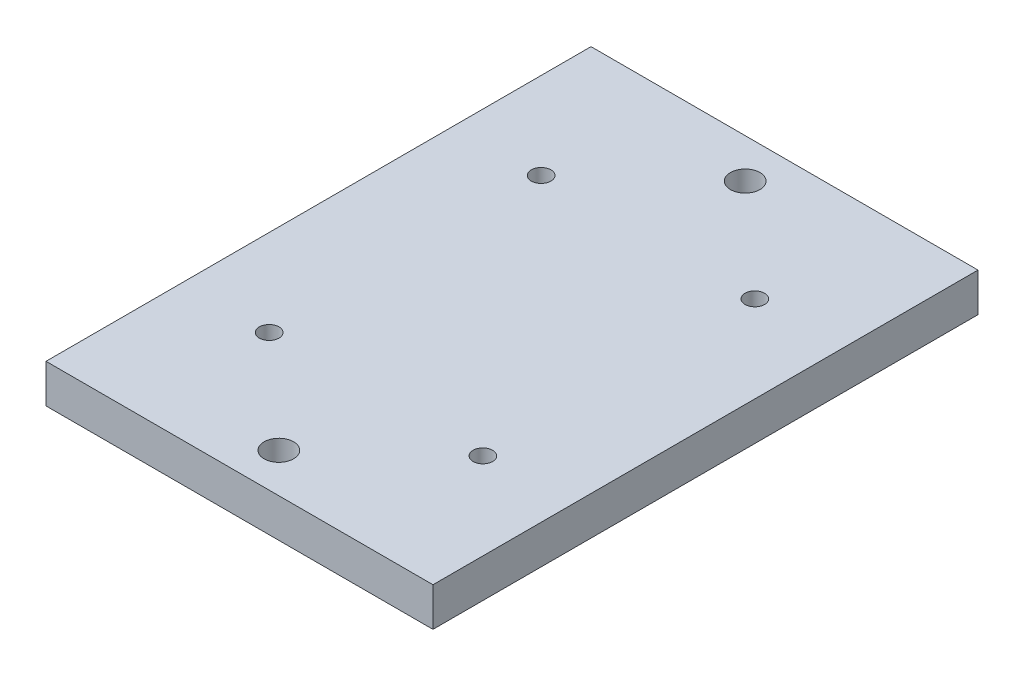
ISO-10303-21;
HEADER;
FILE_DESCRIPTION(('STEP AP214'),'2;1');
FILE_NAME('part.step','',(''),(''),'','','');
FILE_SCHEMA(('AUTOMOTIVE_DESIGN { 1 0 10303 214 1 1 1 1 }'));
ENDSEC;
DATA;
#1=APPLICATION_CONTEXT('core data for automotive mechanical design processes');
#2=APPLICATION_PROTOCOL_DEFINITION('international standard','automotive_design',2000,#1);
#3=PRODUCT_CONTEXT('',#1,'mechanical');
#4=PRODUCT('Part','Part','',(#3));
#5=PRODUCT_RELATED_PRODUCT_CATEGORY('part','',(#4));
#6=PRODUCT_DEFINITION_FORMATION('','',#4);
#7=PRODUCT_DEFINITION_CONTEXT('part definition',#1,'design');
#8=PRODUCT_DEFINITION('design','',#6,#7);
#9=PRODUCT_DEFINITION_SHAPE('','',#8);
#10=(LENGTH_UNIT() NAMED_UNIT(*) SI_UNIT(.MILLI.,.METRE.));
#11=(NAMED_UNIT(*) PLANE_ANGLE_UNIT() SI_UNIT($,.RADIAN.));
#12=(NAMED_UNIT(*) SI_UNIT($,.STERADIAN.) SOLID_ANGLE_UNIT());
#13=UNCERTAINTY_MEASURE_WITH_UNIT(LENGTH_MEASURE(1.E-05),#10,'distance_accuracy_value','');
#14=(GEOMETRIC_REPRESENTATION_CONTEXT(3) GLOBAL_UNCERTAINTY_ASSIGNED_CONTEXT((#13)) GLOBAL_UNIT_ASSIGNED_CONTEXT((#10,
#11,#12)) REPRESENTATION_CONTEXT('',''));
#15=CARTESIAN_POINT('',(0.,0.,0.));
#16=DIRECTION('',(0.,0.,1.));
#17=DIRECTION('',(1.,0.,0.));
#18=AXIS2_PLACEMENT_3D('',#15,#16,#17);
#19=CARTESIAN_POINT('',(0.,6.32,0.));
#20=DIRECTION('',(1.,0.,0.));
#21=DIRECTION('',(0.,0.,-1.));
#22=AXIS2_PLACEMENT_3D('',#19,#20,#21);
#23=PLANE('',#22);
#24=DIRECTION('',(0.,0.,1.));
#25=VECTOR('',#24,1.);
#26=CARTESIAN_POINT('',(0.,0.,0.));
#27=LINE('',#26,#25);
#28=CARTESIAN_POINT('',(0.,0.,-89.08));
#29=VERTEX_POINT('',#28);
#30=CARTESIAN_POINT('',(0.,0.,0.));
#31=VERTEX_POINT('',#30);
#32=EDGE_CURVE('E144',#29,#31,#27,.T.);
#33=ORIENTED_EDGE('',*,*,#32,.T.);
#34=DIRECTION('',(0.,-1.,0.));
#35=VECTOR('',#34,1.);
#36=CARTESIAN_POINT('',(0.,6.32,0.));
#37=LINE('',#36,#35);
#38=CARTESIAN_POINT('',(0.,6.32,0.));
#39=VERTEX_POINT('',#38);
#40=EDGE_CURVE('E125',#39,#31,#37,.T.);
#41=ORIENTED_EDGE('',*,*,#40,.F.);
#42=DIRECTION('',(0.,0.,1.));
#43=VECTOR('',#42,1.);
#44=CARTESIAN_POINT('',(0.,6.32,0.));
#45=LINE('',#44,#43);
#46=CARTESIAN_POINT('',(0.,6.32,-89.08));
#47=VERTEX_POINT('',#46);
#48=EDGE_CURVE('E132',#47,#39,#45,.T.);
#49=ORIENTED_EDGE('',*,*,#48,.F.);
#50=DIRECTION('',(0.,-1.,0.));
#51=VECTOR('',#50,1.);
#52=CARTESIAN_POINT('',(0.,6.32,-89.08));
#53=LINE('',#52,#51);
#54=EDGE_CURVE('E236',#47,#29,#53,.T.);
#55=ORIENTED_EDGE('',*,*,#54,.T.);
#56=EDGE_LOOP('',(#33,#41,#49,#55));
#57=FACE_BOUND('',#56,.T.);
#58=ADVANCED_FACE('F33',(#57),#23,.F.);
#59=CARTESIAN_POINT('',(0.,6.32,0.));
#60=DIRECTION('',(0.,0.,-1.));
#61=DIRECTION('',(-1.,0.,0.));
#62=AXIS2_PLACEMENT_3D('',#59,#60,#61);
#63=PLANE('',#62);
#64=DIRECTION('',(1.,0.,0.));
#65=VECTOR('',#64,1.);
#66=CARTESIAN_POINT('',(0.,0.,0.));
#67=LINE('',#66,#65);
#68=CARTESIAN_POINT('',(63.25,0.,0.));
#69=VERTEX_POINT('',#68);
#70=EDGE_CURVE('E238',#31,#69,#67,.T.);
#71=ORIENTED_EDGE('',*,*,#70,.T.);
#72=DIRECTION('',(0.,-1.,0.));
#73=VECTOR('',#72,1.);
#74=CARTESIAN_POINT('',(63.25,6.32,0.));
#75=LINE('',#74,#73);
#76=CARTESIAN_POINT('',(63.25,6.32,0.));
#77=VERTEX_POINT('',#76);
#78=EDGE_CURVE('E128',#77,#69,#75,.T.);
#79=ORIENTED_EDGE('',*,*,#78,.F.);
#80=DIRECTION('',(1.,0.,0.));
#81=VECTOR('',#80,1.);
#82=CARTESIAN_POINT('',(0.,6.32,0.));
#83=LINE('',#82,#81);
#84=EDGE_CURVE('E121',#39,#77,#83,.T.);
#85=ORIENTED_EDGE('',*,*,#84,.F.);
#86=ORIENTED_EDGE('',*,*,#40,.T.);
#87=EDGE_LOOP('',(#71,#79,#85,#86));
#88=FACE_BOUND('',#87,.T.);
#89=ADVANCED_FACE('F123',(#88),#63,.F.);
#90=CARTESIAN_POINT('',(63.25,6.32,0.));
#91=DIRECTION('',(-1.,0.,0.));
#92=DIRECTION('',(0.,0.,1.));
#93=AXIS2_PLACEMENT_3D('',#90,#91,#92);
#94=PLANE('',#93);
#95=DIRECTION('',(0.,0.,-1.));
#96=VECTOR('',#95,1.);
#97=CARTESIAN_POINT('',(63.25,0.,0.));
#98=LINE('',#97,#96);
#99=CARTESIAN_POINT('',(63.25,0.,-89.08));
#100=VERTEX_POINT('',#99);
#101=EDGE_CURVE('E240',#69,#100,#98,.T.);
#102=ORIENTED_EDGE('',*,*,#101,.T.);
#103=DIRECTION('',(0.,-1.,0.));
#104=VECTOR('',#103,1.);
#105=CARTESIAN_POINT('',(63.25,6.32,-89.08));
#106=LINE('',#105,#104);
#107=CARTESIAN_POINT('',(63.25,6.32,-89.08));
#108=VERTEX_POINT('',#107);
#109=EDGE_CURVE('E149',#108,#100,#106,.T.);
#110=ORIENTED_EDGE('',*,*,#109,.F.);
#111=DIRECTION('',(0.,0.,-1.));
#112=VECTOR('',#111,1.);
#113=CARTESIAN_POINT('',(63.25,6.32,0.));
#114=LINE('',#113,#112);
#115=EDGE_CURVE('E131',#77,#108,#114,.T.);
#116=ORIENTED_EDGE('',*,*,#115,.F.);
#117=ORIENTED_EDGE('',*,*,#78,.T.);
#118=EDGE_LOOP('',(#102,#110,#116,#117));
#119=FACE_BOUND('',#118,.T.);
#120=ADVANCED_FACE('F251',(#119),#94,.F.);
#121=CARTESIAN_POINT('',(0.,6.32,-89.08));
#122=DIRECTION('',(0.,0.,1.));
#123=DIRECTION('',(1.,0.,0.));
#124=AXIS2_PLACEMENT_3D('',#121,#122,#123);
#125=PLANE('',#124);
#126=DIRECTION('',(-1.,0.,0.));
#127=VECTOR('',#126,1.);
#128=CARTESIAN_POINT('',(0.,0.,-89.08));
#129=LINE('',#128,#127);
#130=EDGE_CURVE('E141',#100,#29,#129,.T.);
#131=ORIENTED_EDGE('',*,*,#130,.T.);
#132=ORIENTED_EDGE('',*,*,#54,.F.);
#133=DIRECTION('',(-1.,0.,0.));
#134=VECTOR('',#133,1.);
#135=CARTESIAN_POINT('',(0.,6.32,-89.08));
#136=LINE('',#135,#134);
#137=EDGE_CURVE('E137',#108,#47,#136,.T.);
#138=ORIENTED_EDGE('',*,*,#137,.F.);
#139=ORIENTED_EDGE('',*,*,#109,.T.);
#140=EDGE_LOOP('',(#131,#132,#138,#139));
#141=FACE_BOUND('',#140,.T.);
#142=ADVANCED_FACE('F247',(#141),#125,.F.);
#143=CARTESIAN_POINT('',(0.,6.32,0.));
#144=DIRECTION('',(0.,-1.,0.));
#145=DIRECTION('',(0.,0.,-1.));
#146=AXIS2_PLACEMENT_3D('',#143,#144,#145);
#147=PLANE('',#146);
#148=CARTESIAN_POINT('',(14.16,6.32,-22.315));
#149=DIRECTION('',(0.,-1.,0.));
#150=DIRECTION('',(0.,0.,-1.));
#151=AXIS2_PLACEMENT_3D('',#148,#149,#150);
#152=CIRCLE('',#151,1.6);
#153=CARTESIAN_POINT('',(14.16,6.32,-23.915));
#154=VERTEX_POINT('',#153);
#155=EDGE_CURVE('E429',#154,#154,#152,.T.);
#156=ORIENTED_EDGE('',*,*,#155,.T.);
#157=EDGE_LOOP('',(#156));
#158=FACE_BOUND('',#157,.T.);
#159=CARTESIAN_POINT('',(14.16,6.32,-66.765));
#160=DIRECTION('',(0.,-1.,0.));
#161=DIRECTION('',(0.,0.,-1.));
#162=AXIS2_PLACEMENT_3D('',#159,#160,#161);
#163=CIRCLE('',#162,1.6);
#164=CARTESIAN_POINT('',(14.16,6.32,-68.365));
#165=VERTEX_POINT('',#164);
#166=EDGE_CURVE('E437',#165,#165,#163,.T.);
#167=ORIENTED_EDGE('',*,*,#166,.T.);
#168=EDGE_LOOP('',(#167));
#169=FACE_BOUND('',#168,.T.);
#170=CARTESIAN_POINT('',(49.09,6.32,-66.765));
#171=DIRECTION('',(0.,-1.,0.));
#172=DIRECTION('',(0.,0.,-1.));
#173=AXIS2_PLACEMENT_3D('',#170,#171,#172);
#174=CIRCLE('',#173,1.6);
#175=CARTESIAN_POINT('',(49.09,6.32,-68.365));
#176=VERTEX_POINT('',#175);
#177=EDGE_CURVE('E443',#176,#176,#174,.T.);
#178=ORIENTED_EDGE('',*,*,#177,.T.);
#179=EDGE_LOOP('',(#178));
#180=FACE_BOUND('',#179,.T.);
#181=CARTESIAN_POINT('',(49.09,6.32,-22.315));
#182=DIRECTION('',(0.,-1.,0.));
#183=DIRECTION('',(0.,0.,-1.));
#184=AXIS2_PLACEMENT_3D('',#181,#182,#183);
#185=CIRCLE('',#184,1.6);
#186=CARTESIAN_POINT('',(49.09,6.32,-23.915));
#187=VERTEX_POINT('',#186);
#188=EDGE_CURVE('E191',#187,#187,#185,.T.);
#189=ORIENTED_EDGE('',*,*,#188,.T.);
#190=EDGE_LOOP('',(#189));
#191=FACE_BOUND('',#190,.T.);
#192=CARTESIAN_POINT('',(31.625,6.32,-6.43));
#193=DIRECTION('',(0.,-1.,0.));
#194=DIRECTION('',(0.,0.,-1.));
#195=AXIS2_PLACEMENT_3D('',#192,#193,#194);
#196=CIRCLE('',#195,2.415);
#197=CARTESIAN_POINT('',(31.625,6.32,-8.845));
#198=VERTEX_POINT('',#197);
#199=EDGE_CURVE('E223',#198,#198,#196,.T.);
#200=ORIENTED_EDGE('',*,*,#199,.T.);
#201=EDGE_LOOP('',(#200));
#202=FACE_BOUND('',#201,.T.);
#203=CARTESIAN_POINT('',(31.625,6.32,-82.65));
#204=DIRECTION('',(0.,-1.,0.));
#205=DIRECTION('',(0.,0.,-1.));
#206=AXIS2_PLACEMENT_3D('',#203,#204,#205);
#207=CIRCLE('',#206,2.415);
#208=CARTESIAN_POINT('',(31.625,6.32,-85.065));
#209=VERTEX_POINT('',#208);
#210=EDGE_CURVE('E229',#209,#209,#207,.T.);
#211=ORIENTED_EDGE('',*,*,#210,.T.);
#212=EDGE_LOOP('',(#211));
#213=FACE_BOUND('',#212,.T.);
#214=ORIENTED_EDGE('',*,*,#48,.T.);
#215=ORIENTED_EDGE('',*,*,#84,.T.);
#216=ORIENTED_EDGE('',*,*,#115,.T.);
#217=ORIENTED_EDGE('',*,*,#137,.T.);
#218=EDGE_LOOP('',(#214,#215,#216,#217));
#219=FACE_BOUND('',#218,.T.);
#220=ADVANCED_FACE('F135',(#158,#169,#180,#191,#202,#213,#219),#147,.F.);
#221=CARTESIAN_POINT('',(0.,0.,0.));
#222=DIRECTION('',(0.,-1.,0.));
#223=DIRECTION('',(0.,0.,-1.));
#224=AXIS2_PLACEMENT_3D('',#221,#222,#223);
#225=PLANE('',#224);
#226=DIRECTION('',(0.,0.,1.));
#227=VECTOR('',#226,1.);
#228=CARTESIAN_POINT('',(56.985,0.,-12.765));
#229=LINE('',#228,#227);
#230=CARTESIAN_POINT('',(56.985,0.,-69.965));
#231=VERTEX_POINT('',#230);
#232=CARTESIAN_POINT('',(56.985,0.,-19.115));
#233=VERTEX_POINT('',#232);
#234=EDGE_CURVE('E184',#231,#233,#229,.T.);
#235=ORIENTED_EDGE('',*,*,#234,.F.);
#236=CARTESIAN_POINT('',(50.635,0.,-69.965));
#237=DIRECTION('',(0.,-1.,0.));
#238=DIRECTION('',(0.,0.,-1.));
#239=AXIS2_PLACEMENT_3D('',#236,#237,#238);
#240=CIRCLE('',#239,6.35);
#241=CARTESIAN_POINT('',(50.635,0.,-76.315));
#242=VERTEX_POINT('',#241);
#243=EDGE_CURVE('E179',#231,#242,#240,.F.);
#244=ORIENTED_EDGE('',*,*,#243,.T.);
#245=DIRECTION('',(1.,0.,0.));
#246=VECTOR('',#245,1.);
#247=CARTESIAN_POINT('',(6.265,0.,-76.315));
#248=LINE('',#247,#246);
#249=CARTESIAN_POINT('',(12.615,0.,-76.315));
#250=VERTEX_POINT('',#249);
#251=EDGE_CURVE('E210',#250,#242,#248,.T.);
#252=ORIENTED_EDGE('',*,*,#251,.F.);
#253=CARTESIAN_POINT('',(12.615,0.,-69.965));
#254=DIRECTION('',(0.,-1.,0.));
#255=DIRECTION('',(0.,0.,-1.));
#256=AXIS2_PLACEMENT_3D('',#253,#254,#255);
#257=CIRCLE('',#256,6.35);
#258=CARTESIAN_POINT('',(6.265,0.,-69.965));
#259=VERTEX_POINT('',#258);
#260=EDGE_CURVE('E177',#250,#259,#257,.F.);
#261=ORIENTED_EDGE('',*,*,#260,.T.);
#262=DIRECTION('',(0.,0.,-1.));
#263=VECTOR('',#262,1.);
#264=CARTESIAN_POINT('',(6.265,0.,-12.765));
#265=LINE('',#264,#263);
#266=CARTESIAN_POINT('',(6.265,0.,-19.115));
#267=VERTEX_POINT('',#266);
#268=EDGE_CURVE('E218',#267,#259,#265,.T.);
#269=ORIENTED_EDGE('',*,*,#268,.F.);
#270=CARTESIAN_POINT('',(12.615,0.,-19.115));
#271=DIRECTION('',(0.,-1.,0.));
#272=DIRECTION('',(0.,0.,-1.));
#273=AXIS2_PLACEMENT_3D('',#270,#271,#272);
#274=CIRCLE('',#273,6.35);
#275=CARTESIAN_POINT('',(12.615,0.,-12.765));
#276=VERTEX_POINT('',#275);
#277=EDGE_CURVE('E11',#267,#276,#274,.F.);
#278=ORIENTED_EDGE('',*,*,#277,.T.);
#279=DIRECTION('',(-1.,0.,0.));
#280=VECTOR('',#279,1.);
#281=CARTESIAN_POINT('',(6.265,0.,-12.765));
#282=LINE('',#281,#280);
#283=CARTESIAN_POINT('',(50.635,0.,-12.765));
#284=VERTEX_POINT('',#283);
#285=EDGE_CURVE('E185',#284,#276,#282,.T.);
#286=ORIENTED_EDGE('',*,*,#285,.F.);
#287=CARTESIAN_POINT('',(50.635,0.,-19.115));
#288=DIRECTION('',(0.,-1.,0.));
#289=DIRECTION('',(0.,0.,-1.));
#290=AXIS2_PLACEMENT_3D('',#287,#288,#289);
#291=CIRCLE('',#290,6.35);
#292=EDGE_CURVE('E41',#284,#233,#291,.F.);
#293=ORIENTED_EDGE('',*,*,#292,.T.);
#294=EDGE_LOOP('',(#235,#244,#252,#261,#269,#278,#286,#293));
#295=FACE_BOUND('',#294,.T.);
#296=CARTESIAN_POINT('',(31.625,0.,-6.43));
#297=DIRECTION('',(0.,-1.,0.));
#298=DIRECTION('',(0.,0.,-1.));
#299=AXIS2_PLACEMENT_3D('',#296,#297,#298);
#300=CIRCLE('',#299,2.415);
#301=CARTESIAN_POINT('',(31.625,0.,-8.845));
#302=VERTEX_POINT('',#301);
#303=EDGE_CURVE('E215',#302,#302,#300,.T.);
#304=ORIENTED_EDGE('',*,*,#303,.F.);
#305=EDGE_LOOP('',(#304));
#306=FACE_BOUND('',#305,.T.);
#307=CARTESIAN_POINT('',(31.625,0.,-82.65));
#308=DIRECTION('',(0.,-1.,0.));
#309=DIRECTION('',(0.,0.,-1.));
#310=AXIS2_PLACEMENT_3D('',#307,#308,#309);
#311=CIRCLE('',#310,2.415);
#312=CARTESIAN_POINT('',(31.625,0.,-85.065));
#313=VERTEX_POINT('',#312);
#314=EDGE_CURVE('E226',#313,#313,#311,.T.);
#315=ORIENTED_EDGE('',*,*,#314,.F.);
#316=EDGE_LOOP('',(#315));
#317=FACE_BOUND('',#316,.T.);
#318=ORIENTED_EDGE('',*,*,#32,.F.);
#319=ORIENTED_EDGE('',*,*,#130,.F.);
#320=ORIENTED_EDGE('',*,*,#101,.F.);
#321=ORIENTED_EDGE('',*,*,#70,.F.);
#322=EDGE_LOOP('',(#318,#319,#320,#321));
#323=FACE_BOUND('',#322,.T.);
#324=ADVANCED_FACE('F182',(#295,#306,#317,#323),#225,.T.);
#325=CARTESIAN_POINT('',(31.625,6.32,-82.65));
#326=DIRECTION('',(0.,-1.,0.));
#327=DIRECTION('',(0.,0.,-1.));
#328=AXIS2_PLACEMENT_3D('',#325,#326,#327);
#329=CYLINDRICAL_SURFACE('',#328,2.415);
#330=ORIENTED_EDGE('',*,*,#210,.F.);
#331=EDGE_LOOP('',(#330));
#332=FACE_BOUND('',#331,.T.);
#333=ORIENTED_EDGE('',*,*,#314,.T.);
#334=EDGE_LOOP('',(#333));
#335=FACE_BOUND('',#334,.T.);
#336=ADVANCED_FACE('F312',(#332,#335),#329,.F.);
#337=CARTESIAN_POINT('',(31.625,6.32,-6.43));
#338=DIRECTION('',(0.,-1.,0.));
#339=DIRECTION('',(0.,0.,-1.));
#340=AXIS2_PLACEMENT_3D('',#337,#338,#339);
#341=CYLINDRICAL_SURFACE('',#340,2.415);
#342=ORIENTED_EDGE('',*,*,#199,.F.);
#343=EDGE_LOOP('',(#342));
#344=FACE_BOUND('',#343,.T.);
#345=ORIENTED_EDGE('',*,*,#303,.T.);
#346=EDGE_LOOP('',(#345));
#347=FACE_BOUND('',#346,.T.);
#348=ADVANCED_FACE('F304',(#344,#347),#341,.F.);
#349=CARTESIAN_POINT('',(56.985,1.37,-12.765));
#350=DIRECTION('',(1.,0.,0.));
#351=DIRECTION('',(0.,0.,-1.));
#352=AXIS2_PLACEMENT_3D('',#349,#350,#351);
#353=PLANE('',#352);
#354=DIRECTION('',(0.,0.,1.));
#355=VECTOR('',#354,1.);
#356=CARTESIAN_POINT('',(56.985,1.37,-12.765));
#357=LINE('',#356,#355);
#358=CARTESIAN_POINT('',(56.985,1.37,-69.965));
#359=VERTEX_POINT('',#358);
#360=CARTESIAN_POINT('',(56.985,1.37,-19.115));
#361=VERTEX_POINT('',#360);
#362=EDGE_CURVE('E202',#359,#361,#357,.T.);
#363=ORIENTED_EDGE('',*,*,#362,.F.);
#364=DIRECTION('',(0.,-1.,0.));
#365=VECTOR('',#364,1.);
#366=CARTESIAN_POINT('',(56.985,0.,-69.965));
#367=LINE('',#366,#365);
#368=EDGE_CURVE('E170',#359,#231,#367,.T.);
#369=ORIENTED_EDGE('',*,*,#368,.T.);
#370=ORIENTED_EDGE('',*,*,#234,.T.);
#371=DIRECTION('',(0.,-1.,0.));
#372=VECTOR('',#371,1.);
#373=CARTESIAN_POINT('',(56.985,1.37,-19.115));
#374=LINE('',#373,#372);
#375=EDGE_CURVE('E168',#233,#361,#374,.F.);
#376=ORIENTED_EDGE('',*,*,#375,.T.);
#377=EDGE_LOOP('',(#363,#369,#370,#376));
#378=FACE_BOUND('',#377,.T.);
#379=ADVANCED_FACE('F188',(#378),#353,.F.);
#380=CARTESIAN_POINT('',(6.265,1.37,-76.315));
#381=DIRECTION('',(0.,0.,-1.));
#382=DIRECTION('',(-1.,0.,0.));
#383=AXIS2_PLACEMENT_3D('',#380,#381,#382);
#384=PLANE('',#383);
#385=DIRECTION('',(1.,0.,0.));
#386=VECTOR('',#385,1.);
#387=CARTESIAN_POINT('',(6.265,1.37,-76.315));
#388=LINE('',#387,#386);
#389=CARTESIAN_POINT('',(12.615,1.37,-76.315));
#390=VERTEX_POINT('',#389);
#391=CARTESIAN_POINT('',(50.635,1.37,-76.315));
#392=VERTEX_POINT('',#391);
#393=EDGE_CURVE('E208',#390,#392,#388,.T.);
#394=ORIENTED_EDGE('',*,*,#393,.F.);
#395=DIRECTION('',(0.,-1.,0.));
#396=VECTOR('',#395,1.);
#397=CARTESIAN_POINT('',(12.615,0.,-76.315));
#398=LINE('',#397,#396);
#399=EDGE_CURVE('E147',#390,#250,#398,.T.);
#400=ORIENTED_EDGE('',*,*,#399,.T.);
#401=ORIENTED_EDGE('',*,*,#251,.T.);
#402=DIRECTION('',(0.,-1.,0.));
#403=VECTOR('',#402,1.);
#404=CARTESIAN_POINT('',(50.635,1.37,-76.315));
#405=LINE('',#404,#403);
#406=EDGE_CURVE('E145',#242,#392,#405,.F.);
#407=ORIENTED_EDGE('',*,*,#406,.T.);
#408=EDGE_LOOP('',(#394,#400,#401,#407));
#409=FACE_BOUND('',#408,.T.);
#410=ADVANCED_FACE('F294',(#409),#384,.F.);
#411=CARTESIAN_POINT('',(6.265,1.37,-12.765));
#412=DIRECTION('',(-1.,0.,0.));
#413=DIRECTION('',(0.,0.,1.));
#414=AXIS2_PLACEMENT_3D('',#411,#412,#413);
#415=PLANE('',#414);
#416=ORIENTED_EDGE('',*,*,#268,.T.);
#417=DIRECTION('',(0.,-1.,0.));
#418=VECTOR('',#417,1.);
#419=CARTESIAN_POINT('',(6.265,1.37,-69.965));
#420=LINE('',#419,#418);
#421=CARTESIAN_POINT('',(6.265,1.37,-69.965));
#422=VERTEX_POINT('',#421);
#423=EDGE_CURVE('E158',#259,#422,#420,.F.);
#424=ORIENTED_EDGE('',*,*,#423,.T.);
#425=DIRECTION('',(0.,0.,-1.));
#426=VECTOR('',#425,1.);
#427=CARTESIAN_POINT('',(6.265,1.37,-12.765));
#428=LINE('',#427,#426);
#429=CARTESIAN_POINT('',(6.265,1.37,-19.115));
#430=VERTEX_POINT('',#429);
#431=EDGE_CURVE('E206',#430,#422,#428,.T.);
#432=ORIENTED_EDGE('',*,*,#431,.F.);
#433=DIRECTION('',(0.,-1.,0.));
#434=VECTOR('',#433,1.);
#435=CARTESIAN_POINT('',(6.265,0.,-19.115));
#436=LINE('',#435,#434);
#437=EDGE_CURVE('E155',#430,#267,#436,.T.);
#438=ORIENTED_EDGE('',*,*,#437,.T.);
#439=EDGE_LOOP('',(#416,#424,#432,#438));
#440=FACE_BOUND('',#439,.T.);
#441=ADVANCED_FACE('F288',(#440),#415,.F.);
#442=CARTESIAN_POINT('',(6.265,1.37,-12.765));
#443=DIRECTION('',(0.,0.,1.));
#444=DIRECTION('',(1.,0.,0.));
#445=AXIS2_PLACEMENT_3D('',#442,#443,#444);
#446=PLANE('',#445);
#447=DIRECTION('',(-1.,0.,0.));
#448=VECTOR('',#447,1.);
#449=CARTESIAN_POINT('',(6.265,1.37,-12.765));
#450=LINE('',#449,#448);
#451=CARTESIAN_POINT('',(50.635,1.37,-12.765));
#452=VERTEX_POINT('',#451);
#453=CARTESIAN_POINT('',(12.615,1.37,-12.765));
#454=VERTEX_POINT('',#453);
#455=EDGE_CURVE('E200',#452,#454,#450,.T.);
#456=ORIENTED_EDGE('',*,*,#455,.F.);
#457=DIRECTION('',(0.,-1.,0.));
#458=VECTOR('',#457,1.);
#459=CARTESIAN_POINT('',(50.635,0.,-12.765));
#460=LINE('',#459,#458);
#461=EDGE_CURVE('E175',#452,#284,#460,.T.);
#462=ORIENTED_EDGE('',*,*,#461,.T.);
#463=ORIENTED_EDGE('',*,*,#285,.T.);
#464=DIRECTION('',(0.,-1.,0.));
#465=VECTOR('',#464,1.);
#466=CARTESIAN_POINT('',(12.615,1.37,-12.765));
#467=LINE('',#466,#465);
#468=EDGE_CURVE('E173',#276,#454,#467,.F.);
#469=ORIENTED_EDGE('',*,*,#468,.T.);
#470=EDGE_LOOP('',(#456,#462,#463,#469));
#471=FACE_BOUND('',#470,.T.);
#472=ADVANCED_FACE('F204',(#471),#446,.F.);
#473=CARTESIAN_POINT('',(0.,1.37,0.));
#474=DIRECTION('',(0.,-1.,0.));
#475=DIRECTION('',(0.,0.,-1.));
#476=AXIS2_PLACEMENT_3D('',#473,#474,#475);
#477=PLANE('',#476);
#478=CARTESIAN_POINT('',(14.16,1.37,-22.315));
#479=DIRECTION('',(0.,-1.,0.));
#480=DIRECTION('',(0.,0.,-1.));
#481=AXIS2_PLACEMENT_3D('',#478,#479,#480);
#482=CIRCLE('',#481,1.6);
#483=CARTESIAN_POINT('',(14.16,1.37,-23.915));
#484=VERTEX_POINT('',#483);
#485=EDGE_CURVE('E432',#484,#484,#482,.T.);
#486=ORIENTED_EDGE('',*,*,#485,.F.);
#487=EDGE_LOOP('',(#486));
#488=FACE_BOUND('',#487,.T.);
#489=CARTESIAN_POINT('',(14.16,1.37,-66.765));
#490=DIRECTION('',(0.,-1.,0.));
#491=DIRECTION('',(0.,0.,-1.));
#492=AXIS2_PLACEMENT_3D('',#489,#490,#491);
#493=CIRCLE('',#492,1.6);
#494=CARTESIAN_POINT('',(14.16,1.37,-68.365));
#495=VERTEX_POINT('',#494);
#496=EDGE_CURVE('E434',#495,#495,#493,.T.);
#497=ORIENTED_EDGE('',*,*,#496,.F.);
#498=EDGE_LOOP('',(#497));
#499=FACE_BOUND('',#498,.T.);
#500=CARTESIAN_POINT('',(49.09,1.37,-66.765));
#501=DIRECTION('',(0.,-1.,0.));
#502=DIRECTION('',(0.,0.,-1.));
#503=AXIS2_PLACEMENT_3D('',#500,#501,#502);
#504=CIRCLE('',#503,1.6);
#505=CARTESIAN_POINT('',(49.09,1.37,-68.365));
#506=VERTEX_POINT('',#505);
#507=EDGE_CURVE('E440',#506,#506,#504,.T.);
#508=ORIENTED_EDGE('',*,*,#507,.F.);
#509=EDGE_LOOP('',(#508));
#510=FACE_BOUND('',#509,.T.);
#511=CARTESIAN_POINT('',(49.09,1.37,-22.315));
#512=DIRECTION('',(0.,-1.,0.));
#513=DIRECTION('',(0.,0.,-1.));
#514=AXIS2_PLACEMENT_3D('',#511,#512,#513);
#515=CIRCLE('',#514,1.6);
#516=CARTESIAN_POINT('',(49.09,1.37,-23.915));
#517=VERTEX_POINT('',#516);
#518=EDGE_CURVE('E446',#517,#517,#515,.T.);
#519=ORIENTED_EDGE('',*,*,#518,.F.);
#520=EDGE_LOOP('',(#519));
#521=FACE_BOUND('',#520,.T.);
#522=ORIENTED_EDGE('',*,*,#431,.T.);
#523=CARTESIAN_POINT('',(12.615,1.37,-69.965));
#524=DIRECTION('',(0.,-1.,0.));
#525=DIRECTION('',(0.,0.,-1.));
#526=AXIS2_PLACEMENT_3D('',#523,#524,#525);
#527=CIRCLE('',#526,6.35);
#528=EDGE_CURVE('E166',#422,#390,#527,.T.);
#529=ORIENTED_EDGE('',*,*,#528,.T.);
#530=ORIENTED_EDGE('',*,*,#393,.T.);
#531=CARTESIAN_POINT('',(50.635,1.37,-69.965));
#532=DIRECTION('',(0.,-1.,0.));
#533=DIRECTION('',(0.,0.,-1.));
#534=AXIS2_PLACEMENT_3D('',#531,#532,#533);
#535=CIRCLE('',#534,6.35);
#536=EDGE_CURVE('E164',#392,#359,#535,.T.);
#537=ORIENTED_EDGE('',*,*,#536,.T.);
#538=ORIENTED_EDGE('',*,*,#362,.T.);
#539=CARTESIAN_POINT('',(50.635,1.37,-19.115));
#540=DIRECTION('',(0.,-1.,0.));
#541=DIRECTION('',(0.,0.,-1.));
#542=AXIS2_PLACEMENT_3D('',#539,#540,#541);
#543=CIRCLE('',#542,6.35);
#544=EDGE_CURVE('E162',#361,#452,#543,.T.);
#545=ORIENTED_EDGE('',*,*,#544,.T.);
#546=ORIENTED_EDGE('',*,*,#455,.T.);
#547=CARTESIAN_POINT('',(12.615,1.37,-19.115));
#548=DIRECTION('',(0.,-1.,0.));
#549=DIRECTION('',(0.,0.,-1.));
#550=AXIS2_PLACEMENT_3D('',#547,#548,#549);
#551=CIRCLE('',#550,6.35);
#552=EDGE_CURVE('E160',#454,#430,#551,.T.);
#553=ORIENTED_EDGE('',*,*,#552,.T.);
#554=EDGE_LOOP('',(#522,#529,#530,#537,#538,#545,#546,#553));
#555=FACE_BOUND('',#554,.T.);
#556=ADVANCED_FACE('F199',(#488,#499,#510,#521,#555),#477,.T.);
#557=CARTESIAN_POINT('',(12.615,1.37,-69.965));
#558=DIRECTION('',(0.,1.,0.));
#559=DIRECTION('',(0.,0.,1.));
#560=AXIS2_PLACEMENT_3D('',#557,#558,#559);
#561=CYLINDRICAL_SURFACE('',#560,6.35);
#562=ORIENTED_EDGE('',*,*,#528,.F.);
#563=ORIENTED_EDGE('',*,*,#423,.F.);
#564=ORIENTED_EDGE('',*,*,#260,.F.);
#565=ORIENTED_EDGE('',*,*,#399,.F.);
#566=EDGE_LOOP('',(#562,#563,#564,#565));
#567=FACE_BOUND('',#566,.T.);
#568=ADVANCED_FACE('F265',(#567),#561,.F.);
#569=CARTESIAN_POINT('',(50.635,1.37,-69.965));
#570=DIRECTION('',(0.,1.,0.));
#571=DIRECTION('',(0.,0.,1.));
#572=AXIS2_PLACEMENT_3D('',#569,#570,#571);
#573=CYLINDRICAL_SURFACE('',#572,6.35);
#574=ORIENTED_EDGE('',*,*,#536,.F.);
#575=ORIENTED_EDGE('',*,*,#406,.F.);
#576=ORIENTED_EDGE('',*,*,#243,.F.);
#577=ORIENTED_EDGE('',*,*,#368,.F.);
#578=EDGE_LOOP('',(#574,#575,#576,#577));
#579=FACE_BOUND('',#578,.T.);
#580=ADVANCED_FACE('F268',(#579),#573,.F.);
#581=CARTESIAN_POINT('',(50.635,1.37,-19.115));
#582=DIRECTION('',(0.,1.,0.));
#583=DIRECTION('',(0.,0.,1.));
#584=AXIS2_PLACEMENT_3D('',#581,#582,#583);
#585=CYLINDRICAL_SURFACE('',#584,6.35);
#586=ORIENTED_EDGE('',*,*,#544,.F.);
#587=ORIENTED_EDGE('',*,*,#375,.F.);
#588=ORIENTED_EDGE('',*,*,#292,.F.);
#589=ORIENTED_EDGE('',*,*,#461,.F.);
#590=EDGE_LOOP('',(#586,#587,#588,#589));
#591=FACE_BOUND('',#590,.T.);
#592=ADVANCED_FACE('F194',(#591),#585,.F.);
#593=CARTESIAN_POINT('',(12.615,1.37,-19.115));
#594=DIRECTION('',(0.,1.,0.));
#595=DIRECTION('',(0.,0.,1.));
#596=AXIS2_PLACEMENT_3D('',#593,#594,#595);
#597=CYLINDRICAL_SURFACE('',#596,6.35);
#598=ORIENTED_EDGE('',*,*,#552,.F.);
#599=ORIENTED_EDGE('',*,*,#468,.F.);
#600=ORIENTED_EDGE('',*,*,#277,.F.);
#601=ORIENTED_EDGE('',*,*,#437,.F.);
#602=EDGE_LOOP('',(#598,#599,#600,#601));
#603=FACE_BOUND('',#602,.T.);
#604=ADVANCED_FACE('F35',(#603),#597,.F.);
#605=CARTESIAN_POINT('',(49.09,6.32,-22.315));
#606=DIRECTION('',(0.,-1.,0.));
#607=DIRECTION('',(0.,0.,-1.));
#608=AXIS2_PLACEMENT_3D('',#605,#606,#607);
#609=CYLINDRICAL_SURFACE('',#608,1.6);
#610=ORIENTED_EDGE('',*,*,#188,.F.);
#611=EDGE_LOOP('',(#610));
#612=FACE_BOUND('',#611,.T.);
#613=ORIENTED_EDGE('',*,*,#518,.T.);
#614=EDGE_LOOP('',(#613));
#615=FACE_BOUND('',#614,.T.);
#616=ADVANCED_FACE('F276',(#612,#615),#609,.F.);
#617=CARTESIAN_POINT('',(49.09,6.32,-66.765));
#618=DIRECTION('',(0.,-1.,0.));
#619=DIRECTION('',(0.,0.,-1.));
#620=AXIS2_PLACEMENT_3D('',#617,#618,#619);
#621=CYLINDRICAL_SURFACE('',#620,1.6);
#622=ORIENTED_EDGE('',*,*,#177,.F.);
#623=EDGE_LOOP('',(#622));
#624=FACE_BOUND('',#623,.T.);
#625=ORIENTED_EDGE('',*,*,#507,.T.);
#626=EDGE_LOOP('',(#625));
#627=FACE_BOUND('',#626,.T.);
#628=ADVANCED_FACE('F281',(#624,#627),#621,.F.);
#629=CARTESIAN_POINT('',(14.16,6.32,-66.765));
#630=DIRECTION('',(0.,-1.,0.));
#631=DIRECTION('',(0.,0.,-1.));
#632=AXIS2_PLACEMENT_3D('',#629,#630,#631);
#633=CYLINDRICAL_SURFACE('',#632,1.6);
#634=ORIENTED_EDGE('',*,*,#166,.F.);
#635=EDGE_LOOP('',(#634));
#636=FACE_BOUND('',#635,.T.);
#637=ORIENTED_EDGE('',*,*,#496,.T.);
#638=EDGE_LOOP('',(#637));
#639=FACE_BOUND('',#638,.T.);
#640=ADVANCED_FACE('F402',(#636,#639),#633,.F.);
#641=CARTESIAN_POINT('',(14.16,6.32,-22.315));
#642=DIRECTION('',(0.,-1.,0.));
#643=DIRECTION('',(0.,0.,-1.));
#644=AXIS2_PLACEMENT_3D('',#641,#642,#643);
#645=CYLINDRICAL_SURFACE('',#644,1.6);
#646=ORIENTED_EDGE('',*,*,#155,.F.);
#647=EDGE_LOOP('',(#646));
#648=FACE_BOUND('',#647,.T.);
#649=ORIENTED_EDGE('',*,*,#485,.T.);
#650=EDGE_LOOP('',(#649));
#651=FACE_BOUND('',#650,.T.);
#652=ADVANCED_FACE('F412',(#648,#651),#645,.F.);
#653=CLOSED_SHELL('',(#58,#89,#120,#142,#220,#324,#336,#348,#379,#410,#441,#472,#556,#568,#580,
#592,#604,#616,#628,#640,#652));
#654=MANIFOLD_SOLID_BREP('B2',#653);
#655=ADVANCED_BREP_SHAPE_REPRESENTATION('',(#18,#654),#14);
#656=SHAPE_DEFINITION_REPRESENTATION(#9,#655);
ENDSEC;
END-ISO-10303-21;
